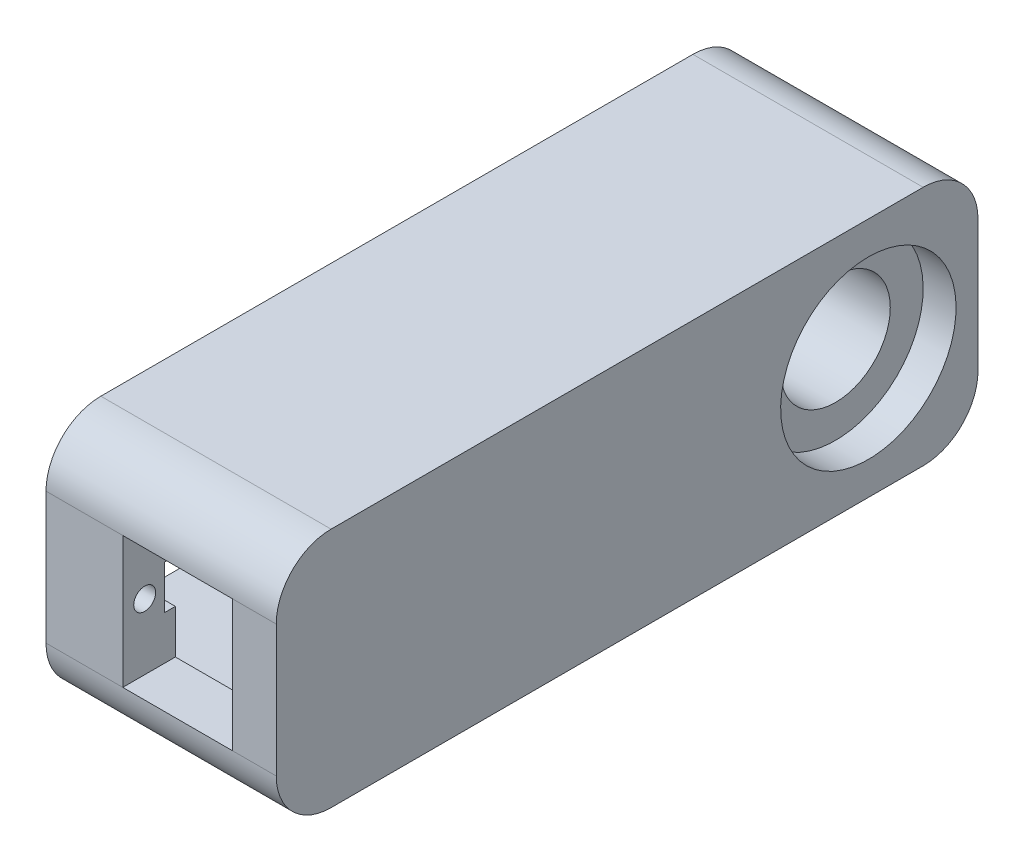
ISO-10303-21;
HEADER;
FILE_DESCRIPTION(('STEP AP214'),'2;1');
FILE_NAME('part.step','',(''),(''),'','','');
FILE_SCHEMA(('AUTOMOTIVE_DESIGN { 1 0 10303 214 1 1 1 1 }'));
ENDSEC;
DATA;
#1=APPLICATION_CONTEXT('core data for automotive mechanical design processes');
#2=APPLICATION_PROTOCOL_DEFINITION('international standard','automotive_design',2000,#1);
#3=PRODUCT_CONTEXT('',#1,'mechanical');
#4=PRODUCT('Part','Part','',(#3));
#5=PRODUCT_RELATED_PRODUCT_CATEGORY('part','',(#4));
#6=PRODUCT_DEFINITION_FORMATION('','',#4);
#7=PRODUCT_DEFINITION_CONTEXT('part definition',#1,'design');
#8=PRODUCT_DEFINITION('design','',#6,#7);
#9=PRODUCT_DEFINITION_SHAPE('','',#8);
#10=(LENGTH_UNIT() NAMED_UNIT(*) SI_UNIT(.MILLI.,.METRE.));
#11=(NAMED_UNIT(*) PLANE_ANGLE_UNIT() SI_UNIT($,.RADIAN.));
#12=(NAMED_UNIT(*) SI_UNIT($,.STERADIAN.) SOLID_ANGLE_UNIT());
#13=UNCERTAINTY_MEASURE_WITH_UNIT(LENGTH_MEASURE(1.E-05),#10,'distance_accuracy_value','');
#14=(GEOMETRIC_REPRESENTATION_CONTEXT(3) GLOBAL_UNCERTAINTY_ASSIGNED_CONTEXT((#13)) GLOBAL_UNIT_ASSIGNED_CONTEXT((#10,
#11,#12)) REPRESENTATION_CONTEXT('',''));
#15=CARTESIAN_POINT('',(0.,0.,0.));
#16=DIRECTION('',(0.,0.,1.));
#17=DIRECTION('',(1.,0.,0.));
#18=AXIS2_PLACEMENT_3D('',#15,#16,#17);
#19=CARTESIAN_POINT('',(72.2543738784994,65.0424365132959,-66.5000000745058));
#20=DIRECTION('',(-1.,0.,0.));
#21=DIRECTION('',(0.,-1.,0.));
#22=AXIS2_PLACEMENT_3D('',#19,#20,#21);
#23=CYLINDRICAL_SURFACE('',#22,5.);
#24=CARTESIAN_POINT('',(37.1122382547684,65.0424365132959,-66.5000000745058));
#25=DIRECTION('',(-1.,0.,0.));
#26=DIRECTION('',(0.,-1.,0.));
#27=AXIS2_PLACEMENT_3D('',#24,#25,#26);
#28=CIRCLE('',#27,5.);
#29=CARTESIAN_POINT('',(37.1122382547684,60.0424365132959,-66.5000000745058));
#30=VERTEX_POINT('',#29);
#31=EDGE_CURVE('E244',#30,#30,#28,.T.);
#32=ORIENTED_EDGE('',*,*,#31,.T.);
#33=EDGE_LOOP('',(#32));
#34=FACE_BOUND('',#33,.T.);
#35=CARTESIAN_POINT('',(55.1122382547684,65.0424365132959,-66.5000000745058));
#36=DIRECTION('',(1.,0.,0.));
#37=DIRECTION('',(0.,1.,0.));
#38=AXIS2_PLACEMENT_3D('',#35,#36,#37);
#39=CIRCLE('',#38,5.);
#40=CARTESIAN_POINT('',(55.1122382547684,70.0424365132959,-66.5000000745058));
#41=VERTEX_POINT('',#40);
#42=EDGE_CURVE('E40',#41,#41,#39,.F.);
#43=ORIENTED_EDGE('',*,*,#42,.F.);
#44=EDGE_LOOP('',(#43));
#45=FACE_BOUND('',#44,.T.);
#46=ADVANCED_FACE('F36',(#34,#45),#23,.F.);
#47=CARTESIAN_POINT('',(37.1122382547684,65.0424365132959,-14.9999998733401));
#48=DIRECTION('',(-1.,0.,0.));
#49=DIRECTION('',(0.,0.,1.));
#50=AXIS2_PLACEMENT_3D('',#47,#48,#49);
#51=PLANE('',#50);
#52=DIRECTION('',(0.,0.,1.));
#53=VECTOR('',#52,1.);
#54=CARTESIAN_POINT('',(37.1122382547684,67.0424365132959,-17.299999910593));
#55=LINE('',#54,#53);
#56=CARTESIAN_POINT('',(37.1122382547684,67.0424365132959,-17.299999910593));
#57=VERTEX_POINT('',#56);
#58=CARTESIAN_POINT('',(37.1122382547684,67.0424365132959,-16.299999910593));
#59=VERTEX_POINT('',#58);
#60=EDGE_CURVE('E313',#57,#59,#55,.T.);
#61=ORIENTED_EDGE('',*,*,#60,.T.);
#62=DIRECTION('',(0.,-1.,0.));
#63=VECTOR('',#62,1.);
#64=CARTESIAN_POINT('',(37.1122382547684,63.0424365132959,-16.299999910593));
#65=LINE('',#64,#63);
#66=CARTESIAN_POINT('',(37.1122382547684,63.0424365132959,-16.299999910593));
#67=VERTEX_POINT('',#66);
#68=EDGE_CURVE('E282',#59,#67,#65,.T.);
#69=ORIENTED_EDGE('',*,*,#68,.T.);
#70=DIRECTION('',(0.,0.,-1.));
#71=VECTOR('',#70,1.);
#72=CARTESIAN_POINT('',(37.1122382547684,63.0424365132959,-17.299999910593));
#73=LINE('',#72,#71);
#74=CARTESIAN_POINT('',(37.1122382547684,63.0424365132959,-17.299999910593));
#75=VERTEX_POINT('',#74);
#76=EDGE_CURVE('E316',#67,#75,#73,.T.);
#77=ORIENTED_EDGE('',*,*,#76,.T.);
#78=DIRECTION('',(0.,1.,0.));
#79=VECTOR('',#78,1.);
#80=CARTESIAN_POINT('',(37.1122382547684,71.2424366027028,-17.299999910593));
#81=LINE('',#80,#79);
#82=CARTESIAN_POINT('',(37.1122382547684,58.8424364238889,-17.299999910593));
#83=VERTEX_POINT('',#82);
#84=EDGE_CURVE('E273',#83,#75,#81,.T.);
#85=ORIENTED_EDGE('',*,*,#84,.F.);
#86=DIRECTION('',(0.,0.,1.));
#87=VECTOR('',#86,1.);
#88=CARTESIAN_POINT('',(37.1122382547684,58.8424364238889,-39.7000002384186));
#89=LINE('',#88,#87);
#90=CARTESIAN_POINT('',(37.1122382547684,58.8424364238889,-39.7000002384186));
#91=VERTEX_POINT('',#90);
#92=EDGE_CURVE('E277',#91,#83,#89,.T.);
#93=ORIENTED_EDGE('',*,*,#92,.F.);
#94=DIRECTION('',(0.,-1.,0.));
#95=VECTOR('',#94,1.);
#96=CARTESIAN_POINT('',(37.1122382547684,71.2424366027028,-39.7000002384186));
#97=LINE('',#96,#95);
#98=CARTESIAN_POINT('',(37.1122382547684,71.2424366027028,-39.7000002384186));
#99=VERTEX_POINT('',#98);
#100=EDGE_CURVE('E280',#99,#91,#97,.T.);
#101=ORIENTED_EDGE('',*,*,#100,.F.);
#102=DIRECTION('',(0.,0.,-1.));
#103=VECTOR('',#102,1.);
#104=CARTESIAN_POINT('',(37.1122382547684,71.2424366027028,-39.7000002384186));
#105=LINE('',#104,#103);
#106=CARTESIAN_POINT('',(37.1122382547684,71.2424366027028,-17.299999910593));
#107=VERTEX_POINT('',#106);
#108=EDGE_CURVE('E269',#107,#99,#105,.T.);
#109=ORIENTED_EDGE('',*,*,#108,.F.);
#110=EDGE_CURVE('E276',#57,#107,#81,.T.);
#111=ORIENTED_EDGE('',*,*,#110,.F.);
#112=EDGE_LOOP('',(#61,#69,#77,#85,#93,#101,#109,#111));
#113=FACE_BOUND('',#112,.T.);
#114=ORIENTED_EDGE('',*,*,#31,.F.);
#115=EDGE_LOOP('',(#114));
#116=FACE_BOUND('',#115,.T.);
#117=CARTESIAN_POINT('',(37.1122382547684,65.0424365132959,-14.4999998360872));
#118=DIRECTION('',(-1.,0.,0.));
#119=DIRECTION('',(0.,-1.,0.));
#120=AXIS2_PLACEMENT_3D('',#117,#118,#119);
#121=CIRCLE('',#120,0.999999999999964);
#122=CARTESIAN_POINT('',(37.1122382547684,64.0424365132959,-14.4999998360872));
#123=VERTEX_POINT('',#122);
#124=EDGE_CURVE('E240',#123,#123,#121,.T.);
#125=ORIENTED_EDGE('',*,*,#124,.F.);
#126=EDGE_LOOP('',(#125));
#127=FACE_BOUND('',#126,.T.);
#128=CARTESIAN_POINT('',(37.1122382547684,65.0424365132959,-42.5000003129244));
#129=DIRECTION('',(-1.,0.,0.));
#130=DIRECTION('',(0.,-1.,0.));
#131=AXIS2_PLACEMENT_3D('',#128,#129,#130);
#132=CIRCLE('',#131,0.999999999999968);
#133=CARTESIAN_POINT('',(37.1122382547684,64.0424365132959,-42.5000003129244));
#134=VERTEX_POINT('',#133);
#135=EDGE_CURVE('E241',#134,#134,#132,.T.);
#136=ORIENTED_EDGE('',*,*,#135,.F.);
#137=EDGE_LOOP('',(#136));
#138=FACE_BOUND('',#137,.T.);
#139=DIRECTION('',(0.,0.,-1.));
#140=VECTOR('',#139,1.);
#141=CARTESIAN_POINT('',(37.1122382547684,54.0424365132959,-12.5000000745058));
#142=LINE('',#141,#140);
#143=CARTESIAN_POINT('',(37.1122382547684,54.0424365132959,-17.5000000745058));
#144=VERTEX_POINT('',#143);
#145=CARTESIAN_POINT('',(37.1122382547684,54.0424365132959,-71.5000000745058));
#146=VERTEX_POINT('',#145);
#147=EDGE_CURVE('E192',#144,#146,#142,.T.);
#148=ORIENTED_EDGE('',*,*,#147,.F.);
#149=CARTESIAN_POINT('',(37.1122382547684,59.0424365132959,-17.5000000745058));
#150=DIRECTION('',(1.,0.,0.));
#151=DIRECTION('',(0.,1.,0.));
#152=AXIS2_PLACEMENT_3D('',#149,#150,#151);
#153=CIRCLE('',#152,5.);
#154=CARTESIAN_POINT('',(37.1122382547684,59.0424365132959,-12.5000000745058));
#155=VERTEX_POINT('',#154);
#156=EDGE_CURVE('E340',#155,#144,#153,.T.);
#157=ORIENTED_EDGE('',*,*,#156,.F.);
#158=DIRECTION('',(0.,-1.,0.));
#159=VECTOR('',#158,1.);
#160=CARTESIAN_POINT('',(37.1122382547684,76.0424365132959,-12.5000000745058));
#161=LINE('',#160,#159);
#162=CARTESIAN_POINT('',(37.1122382547684,71.0424365132959,-12.5000000745058));
#163=VERTEX_POINT('',#162);
#164=EDGE_CURVE('E196',#163,#155,#161,.T.);
#165=ORIENTED_EDGE('',*,*,#164,.F.);
#166=CARTESIAN_POINT('',(37.1122382547684,71.0424365132959,-17.5000000745058));
#167=DIRECTION('',(1.,0.,0.));
#168=DIRECTION('',(0.,1.,0.));
#169=AXIS2_PLACEMENT_3D('',#166,#167,#168);
#170=CIRCLE('',#169,5.);
#171=CARTESIAN_POINT('',(37.1122382547684,76.0424365132959,-17.5000000745058));
#172=VERTEX_POINT('',#171);
#173=EDGE_CURVE('E324',#172,#163,#170,.T.);
#174=ORIENTED_EDGE('',*,*,#173,.F.);
#175=DIRECTION('',(0.,0.,1.));
#176=VECTOR('',#175,1.);
#177=CARTESIAN_POINT('',(37.1122382547684,76.0424365132959,-76.5000000745058));
#178=LINE('',#177,#176);
#179=CARTESIAN_POINT('',(37.1122382547684,76.0424365132959,-71.5000000745058));
#180=VERTEX_POINT('',#179);
#181=EDGE_CURVE('E45',#180,#172,#178,.T.);
#182=ORIENTED_EDGE('',*,*,#181,.F.);
#183=CARTESIAN_POINT('',(37.1122382547684,71.0424365132959,-71.5000000745058));
#184=DIRECTION('',(1.,0.,0.));
#185=DIRECTION('',(0.,1.,0.));
#186=AXIS2_PLACEMENT_3D('',#183,#184,#185);
#187=CIRCLE('',#186,5.);
#188=CARTESIAN_POINT('',(37.1122382547684,71.0424365132959,-76.5000000745058));
#189=VERTEX_POINT('',#188);
#190=EDGE_CURVE('E175',#189,#180,#187,.T.);
#191=ORIENTED_EDGE('',*,*,#190,.F.);
#192=DIRECTION('',(0.,1.,0.));
#193=VECTOR('',#192,1.);
#194=CARTESIAN_POINT('',(37.1122382547684,54.0424365132959,-76.5000000745058));
#195=LINE('',#194,#193);
#196=CARTESIAN_POINT('',(37.1122382547684,59.0424365132959,-76.5000000745058));
#197=VERTEX_POINT('',#196);
#198=EDGE_CURVE('E187',#197,#189,#195,.T.);
#199=ORIENTED_EDGE('',*,*,#198,.F.);
#200=CARTESIAN_POINT('',(37.1122382547684,59.0424365132959,-71.5000000745058));
#201=DIRECTION('',(1.,0.,0.));
#202=DIRECTION('',(0.,1.,0.));
#203=AXIS2_PLACEMENT_3D('',#200,#201,#202);
#204=CIRCLE('',#203,5.);
#205=EDGE_CURVE('E344',#197,#146,#204,.F.);
#206=ORIENTED_EDGE('',*,*,#205,.T.);
#207=EDGE_LOOP('',(#148,#157,#165,#174,#182,#191,#199,#206));
#208=FACE_BOUND('',#207,.T.);
#209=ADVANCED_FACE('F38',(#113,#116,#127,#138,#208),#51,.T.);
#210=CARTESIAN_POINT('',(-30.5634590079861,76.0424365132959,-12.5000000745058));
#211=DIRECTION('',(0.,0.,1.));
#212=DIRECTION('',(1.,0.,0.));
#213=AXIS2_PLACEMENT_3D('',#210,#211,#212);
#214=PLANE('',#213);
#215=ORIENTED_EDGE('',*,*,#164,.T.);
#216=DIRECTION('',(1.,0.,0.));
#217=VECTOR('',#216,1.);
#218=CARTESIAN_POINT('',(37.1122382547684,59.0424365132959,-12.5000000745058));
#219=LINE('',#218,#217);
#220=CARTESIAN_POINT('',(44.1122382547684,59.0424365132959,-12.5000000745058));
#221=VERTEX_POINT('',#220);
#222=EDGE_CURVE('E330',#155,#221,#219,.T.);
#223=ORIENTED_EDGE('',*,*,#222,.T.);
#224=DIRECTION('',(0.,-1.,0.));
#225=VECTOR('',#224,1.);
#226=CARTESIAN_POINT('',(44.1122382547684,71.0424365132959,-12.5000000745058));
#227=LINE('',#226,#225);
#228=CARTESIAN_POINT('',(44.1122382547684,71.0424365132959,-12.5000000745058));
#229=VERTEX_POINT('',#228);
#230=EDGE_CURVE('E227',#229,#221,#227,.T.);
#231=ORIENTED_EDGE('',*,*,#230,.F.);
#232=DIRECTION('',(1.,0.,0.));
#233=VECTOR('',#232,1.);
#234=CARTESIAN_POINT('',(37.1122382547684,71.0424365132959,-12.5000000745058));
#235=LINE('',#234,#233);
#236=EDGE_CURVE('E319',#163,#229,#235,.T.);
#237=ORIENTED_EDGE('',*,*,#236,.F.);
#238=EDGE_LOOP('',(#215,#223,#231,#237));
#239=FACE_BOUND('',#238,.T.);
#240=ADVANCED_FACE('F369',(#239),#214,.T.);
#241=DIRECTION('',(0.,1.,0.));
#242=VECTOR('',#241,1.);
#243=CARTESIAN_POINT('',(54.1122382547684,71.0424365132959,-12.5000000745058));
#244=LINE('',#243,#242);
#245=CARTESIAN_POINT('',(54.1122382547684,59.0424365132959,-12.5000000745058));
#246=VERTEX_POINT('',#245);
#247=CARTESIAN_POINT('',(54.1122382547684,71.0424365132959,-12.5000000745058));
#248=VERTEX_POINT('',#247);
#249=EDGE_CURVE('E233',#246,#248,#244,.T.);
#250=ORIENTED_EDGE('',*,*,#249,.F.);
#251=CARTESIAN_POINT('',(58.1122382547684,59.0424365132959,-12.5000000745058));
#252=VERTEX_POINT('',#251);
#253=EDGE_CURVE('E334',#246,#252,#219,.T.);
#254=ORIENTED_EDGE('',*,*,#253,.T.);
#255=DIRECTION('',(0.,-1.,0.));
#256=VECTOR('',#255,1.);
#257=CARTESIAN_POINT('',(58.1122382547684,76.0424365132959,-12.5000000745058));
#258=LINE('',#257,#256);
#259=CARTESIAN_POINT('',(58.1122382547684,71.0424365132959,-12.5000000745058));
#260=VERTEX_POINT('',#259);
#261=EDGE_CURVE('E206',#260,#252,#258,.T.);
#262=ORIENTED_EDGE('',*,*,#261,.F.);
#263=EDGE_CURVE('E323',#248,#260,#235,.T.);
#264=ORIENTED_EDGE('',*,*,#263,.F.);
#265=EDGE_LOOP('',(#250,#254,#262,#264));
#266=FACE_BOUND('',#265,.T.);
#267=ADVANCED_FACE('F416',(#266),#214,.T.);
#268=CARTESIAN_POINT('',(-30.5634590079861,54.0424365132958,-76.5000000745058));
#269=DIRECTION('',(0.,0.,-1.));
#270=DIRECTION('',(-1.,0.,0.));
#271=AXIS2_PLACEMENT_3D('',#268,#269,#270);
#272=PLANE('',#271);
#273=DIRECTION('',(0.,1.,0.));
#274=VECTOR('',#273,1.);
#275=CARTESIAN_POINT('',(58.1122382547684,54.0424365132959,-76.5000000745058));
#276=LINE('',#275,#274);
#277=CARTESIAN_POINT('',(58.1122382547684,59.0424365132959,-76.5000000745058));
#278=VERTEX_POINT('',#277);
#279=CARTESIAN_POINT('',(58.1122382547684,71.0424365132959,-76.5000000745058));
#280=VERTEX_POINT('',#279);
#281=EDGE_CURVE('E201',#278,#280,#276,.T.);
#282=ORIENTED_EDGE('',*,*,#281,.F.);
#283=DIRECTION('',(1.,0.,0.));
#284=VECTOR('',#283,1.);
#285=CARTESIAN_POINT('',(37.1122382547684,59.0424365132959,-76.5000000745058));
#286=LINE('',#285,#284);
#287=EDGE_CURVE('E52',#197,#278,#286,.T.);
#288=ORIENTED_EDGE('',*,*,#287,.F.);
#289=ORIENTED_EDGE('',*,*,#198,.T.);
#290=DIRECTION('',(1.,0.,0.));
#291=VECTOR('',#290,1.);
#292=CARTESIAN_POINT('',(37.1122382547684,71.0424365132959,-76.5000000745058));
#293=LINE('',#292,#291);
#294=EDGE_CURVE('E172',#189,#280,#293,.T.);
#295=ORIENTED_EDGE('',*,*,#294,.T.);
#296=EDGE_LOOP('',(#282,#288,#289,#295));
#297=FACE_BOUND('',#296,.T.);
#298=ADVANCED_FACE('F191',(#297),#272,.T.);
#299=CARTESIAN_POINT('',(-30.5634590079861,76.0424365132959,-76.5000000745058));
#300=DIRECTION('',(0.,1.,0.));
#301=DIRECTION('',(-1.,0.,0.));
#302=AXIS2_PLACEMENT_3D('',#299,#300,#301);
#303=PLANE('',#302);
#304=DIRECTION('',(1.,0.,0.));
#305=VECTOR('',#304,1.);
#306=CARTESIAN_POINT('',(37.1122382547684,76.0424365132959,-71.5000000745058));
#307=LINE('',#306,#305);
#308=CARTESIAN_POINT('',(58.1122382547684,76.0424365132959,-71.5000000745058));
#309=VERTEX_POINT('',#308);
#310=EDGE_CURVE('E60',#180,#309,#307,.T.);
#311=ORIENTED_EDGE('',*,*,#310,.F.);
#312=ORIENTED_EDGE('',*,*,#181,.T.);
#313=DIRECTION('',(1.,0.,0.));
#314=VECTOR('',#313,1.);
#315=CARTESIAN_POINT('',(37.1122382547684,76.0424365132959,-17.5000000745058));
#316=LINE('',#315,#314);
#317=CARTESIAN_POINT('',(58.1122382547684,76.0424365132959,-17.5000000745058));
#318=VERTEX_POINT('',#317);
#319=EDGE_CURVE('E320',#172,#318,#316,.T.);
#320=ORIENTED_EDGE('',*,*,#319,.T.);
#321=DIRECTION('',(0.,0.,1.));
#322=VECTOR('',#321,1.);
#323=CARTESIAN_POINT('',(58.1122382547684,76.0424365132959,-76.5000000745058));
#324=LINE('',#323,#322);
#325=EDGE_CURVE('E209',#309,#318,#324,.T.);
#326=ORIENTED_EDGE('',*,*,#325,.F.);
#327=EDGE_LOOP('',(#311,#312,#320,#326));
#328=FACE_BOUND('',#327,.T.);
#329=ADVANCED_FACE('F409',(#328),#303,.T.);
#330=CARTESIAN_POINT('',(58.1122382547684,0.,0.));
#331=DIRECTION('',(1.,0.,0.));
#332=DIRECTION('',(0.,1.,0.));
#333=AXIS2_PLACEMENT_3D('',#330,#331,#332);
#334=PLANE('',#333);
#335=CARTESIAN_POINT('',(58.1122382547684,65.0424365132959,-66.5000000745058));
#336=DIRECTION('',(1.,0.,0.));
#337=DIRECTION('',(0.,1.,0.));
#338=AXIS2_PLACEMENT_3D('',#335,#336,#337);
#339=CIRCLE('',#338,7.99999999999999);
#340=CARTESIAN_POINT('',(58.1122382547684,73.0424365132959,-66.5000000745058));
#341=VERTEX_POINT('',#340);
#342=EDGE_CURVE('E351',#341,#341,#339,.T.);
#343=ORIENTED_EDGE('',*,*,#342,.F.);
#344=EDGE_LOOP('',(#343));
#345=FACE_BOUND('',#344,.T.);
#346=ORIENTED_EDGE('',*,*,#261,.T.);
#347=CARTESIAN_POINT('',(58.1122382547684,59.0424365132959,-17.5000000745058));
#348=DIRECTION('',(1.,0.,0.));
#349=DIRECTION('',(0.,1.,0.));
#350=AXIS2_PLACEMENT_3D('',#347,#348,#349);
#351=CIRCLE('',#350,5.);
#352=CARTESIAN_POINT('',(58.1122382547684,54.0424365132959,-17.5000000745058));
#353=VERTEX_POINT('',#352);
#354=EDGE_CURVE('E337',#252,#353,#351,.T.);
#355=ORIENTED_EDGE('',*,*,#354,.T.);
#356=DIRECTION('',(0.,0.,-1.));
#357=VECTOR('',#356,1.);
#358=CARTESIAN_POINT('',(58.1122382547684,54.0424365132959,-12.5000000745058));
#359=LINE('',#358,#357);
#360=CARTESIAN_POINT('',(58.1122382547684,54.0424365132959,-71.5000000745058));
#361=VERTEX_POINT('',#360);
#362=EDGE_CURVE('E203',#353,#361,#359,.T.);
#363=ORIENTED_EDGE('',*,*,#362,.T.);
#364=CARTESIAN_POINT('',(58.1122382547684,59.0424365132959,-71.5000000745058));
#365=DIRECTION('',(1.,0.,0.));
#366=DIRECTION('',(0.,1.,0.));
#367=AXIS2_PLACEMENT_3D('',#364,#365,#366);
#368=CIRCLE('',#367,5.);
#369=EDGE_CURVE('E336',#278,#361,#368,.F.);
#370=ORIENTED_EDGE('',*,*,#369,.F.);
#371=ORIENTED_EDGE('',*,*,#281,.T.);
#372=CARTESIAN_POINT('',(58.1122382547684,71.0424365132959,-71.5000000745058));
#373=DIRECTION('',(1.,0.,0.));
#374=DIRECTION('',(0.,1.,0.));
#375=AXIS2_PLACEMENT_3D('',#372,#373,#374);
#376=CIRCLE('',#375,5.);
#377=EDGE_CURVE('E176',#280,#309,#376,.T.);
#378=ORIENTED_EDGE('',*,*,#377,.T.);
#379=ORIENTED_EDGE('',*,*,#325,.T.);
#380=CARTESIAN_POINT('',(58.1122382547684,71.0424365132959,-17.5000000745058));
#381=DIRECTION('',(1.,0.,0.));
#382=DIRECTION('',(0.,1.,0.));
#383=AXIS2_PLACEMENT_3D('',#380,#381,#382);
#384=CIRCLE('',#383,5.);
#385=EDGE_CURVE('E326',#318,#260,#384,.T.);
#386=ORIENTED_EDGE('',*,*,#385,.T.);
#387=EDGE_LOOP('',(#346,#355,#363,#370,#371,#378,#379,#386));
#388=FACE_BOUND('',#387,.T.);
#389=ADVANCED_FACE('F405',(#345,#388),#334,.T.);
#390=CARTESIAN_POINT('',(54.1122382547684,71.2424366027028,-17.299999910593));
#391=DIRECTION('',(0.,0.,1.));
#392=DIRECTION('',(1.,0.,0.));
#393=AXIS2_PLACEMENT_3D('',#390,#391,#392);
#394=PLANE('',#393);
#395=DIRECTION('',(0.,1.,0.));
#396=VECTOR('',#395,1.);
#397=CARTESIAN_POINT('',(44.1122382547684,71.0424365132959,-17.299999910593));
#398=LINE('',#397,#396);
#399=CARTESIAN_POINT('',(44.1122382547684,67.0424365132959,-17.299999910593));
#400=VERTEX_POINT('',#399);
#401=CARTESIAN_POINT('',(44.1122382547684,71.0424365132959,-17.299999910593));
#402=VERTEX_POINT('',#401);
#403=EDGE_CURVE('E257',#400,#402,#398,.T.);
#404=ORIENTED_EDGE('',*,*,#403,.F.);
#405=DIRECTION('',(1.,0.,0.));
#406=VECTOR('',#405,1.);
#407=CARTESIAN_POINT('',(37.1112382547684,67.0424365132959,-17.299999910593));
#408=LINE('',#407,#406);
#409=EDGE_CURVE('E296',#57,#400,#408,.T.);
#410=ORIENTED_EDGE('',*,*,#409,.F.);
#411=ORIENTED_EDGE('',*,*,#110,.T.);
#412=DIRECTION('',(-1.,0.,0.));
#413=VECTOR('',#412,1.);
#414=CARTESIAN_POINT('',(54.1122382547684,71.2424366027028,-17.299999910593));
#415=LINE('',#414,#413);
#416=CARTESIAN_POINT('',(54.1122382547684,71.2424366027028,-17.299999910593));
#417=VERTEX_POINT('',#416);
#418=EDGE_CURVE('E264',#417,#107,#415,.T.);
#419=ORIENTED_EDGE('',*,*,#418,.F.);
#420=DIRECTION('',(0.,1.,0.));
#421=VECTOR('',#420,1.);
#422=CARTESIAN_POINT('',(54.1122382547684,71.2424366027028,-17.299999910593));
#423=LINE('',#422,#421);
#424=CARTESIAN_POINT('',(54.1122382547684,71.0424365132959,-17.299999910593));
#425=VERTEX_POINT('',#424);
#426=EDGE_CURVE('E288',#425,#417,#423,.T.);
#427=ORIENTED_EDGE('',*,*,#426,.F.);
#428=DIRECTION('',(1.,0.,0.));
#429=VECTOR('',#428,1.);
#430=CARTESIAN_POINT('',(54.1122382547684,71.0424365132959,-17.299999910593));
#431=LINE('',#430,#429);
#432=EDGE_CURVE('E11',#402,#425,#431,.T.);
#433=ORIENTED_EDGE('',*,*,#432,.F.);
#434=EDGE_LOOP('',(#404,#410,#411,#419,#427,#433));
#435=FACE_BOUND('',#434,.T.);
#436=ADVANCED_FACE('F408',(#435),#394,.F.);
#437=CARTESIAN_POINT('',(-30.5634590079861,54.0424365132958,-12.5000000745058));
#438=DIRECTION('',(0.,-1.,0.));
#439=DIRECTION('',(1.,0.,0.));
#440=AXIS2_PLACEMENT_3D('',#437,#438,#439);
#441=PLANE('',#440);
#442=DIRECTION('',(1.,0.,0.));
#443=VECTOR('',#442,1.);
#444=CARTESIAN_POINT('',(37.1122382547684,54.0424365132959,-17.5000000745058));
#445=LINE('',#444,#443);
#446=EDGE_CURVE('E333',#144,#353,#445,.T.);
#447=ORIENTED_EDGE('',*,*,#446,.F.);
#448=ORIENTED_EDGE('',*,*,#147,.T.);
#449=DIRECTION('',(1.,0.,0.));
#450=VECTOR('',#449,1.);
#451=CARTESIAN_POINT('',(37.1122382547684,54.0424365132959,-71.5000000745058));
#452=LINE('',#451,#450);
#453=EDGE_CURVE('E343',#146,#361,#452,.T.);
#454=ORIENTED_EDGE('',*,*,#453,.T.);
#455=ORIENTED_EDGE('',*,*,#362,.F.);
#456=EDGE_LOOP('',(#447,#448,#454,#455));
#457=FACE_BOUND('',#456,.T.);
#458=ADVANCED_FACE('F403',(#457),#441,.T.);
#459=CARTESIAN_POINT('',(54.1122382547684,71.0424365132959,-17.5000000745058));
#460=DIRECTION('',(1.,0.,0.));
#461=DIRECTION('',(0.,0.,-1.));
#462=AXIS2_PLACEMENT_3D('',#459,#460,#461);
#463=PLANE('',#462);
#464=DIRECTION('',(0.,0.,1.));
#465=VECTOR('',#464,1.);
#466=CARTESIAN_POINT('',(54.1122382547684,71.0424365132959,-17.5000000745058));
#467=LINE('',#466,#465);
#468=EDGE_CURVE('E213',#425,#248,#467,.T.);
#469=ORIENTED_EDGE('',*,*,#468,.F.);
#470=ORIENTED_EDGE('',*,*,#426,.T.);
#471=DIRECTION('',(0.,0.,-1.));
#472=VECTOR('',#471,1.);
#473=CARTESIAN_POINT('',(54.1122382547684,71.2424366027028,-39.7000002384186));
#474=LINE('',#473,#472);
#475=CARTESIAN_POINT('',(54.1122382547684,71.2424366027028,-39.7000002384186));
#476=VERTEX_POINT('',#475);
#477=EDGE_CURVE('E262',#417,#476,#474,.T.);
#478=ORIENTED_EDGE('',*,*,#477,.T.);
#479=DIRECTION('',(0.,-1.,0.));
#480=VECTOR('',#479,1.);
#481=CARTESIAN_POINT('',(54.1122382547684,71.2424366027028,-39.7000002384186));
#482=LINE('',#481,#480);
#483=CARTESIAN_POINT('',(54.1122382547684,58.8424364238889,-39.7000002384186));
#484=VERTEX_POINT('',#483);
#485=EDGE_CURVE('E272',#476,#484,#482,.T.);
#486=ORIENTED_EDGE('',*,*,#485,.T.);
#487=DIRECTION('',(0.,0.,1.));
#488=VECTOR('',#487,1.);
#489=CARTESIAN_POINT('',(54.1122382547684,58.8424364238889,-39.7000002384186));
#490=LINE('',#489,#488);
#491=CARTESIAN_POINT('',(54.1122382547684,58.8424364238889,-17.299999910593));
#492=VERTEX_POINT('',#491);
#493=EDGE_CURVE('E289',#484,#492,#490,.T.);
#494=ORIENTED_EDGE('',*,*,#493,.T.);
#495=CARTESIAN_POINT('',(54.1122382547684,59.0424365132959,-17.299999910593));
#496=VERTEX_POINT('',#495);
#497=EDGE_CURVE('E285',#492,#496,#423,.T.);
#498=ORIENTED_EDGE('',*,*,#497,.T.);
#499=DIRECTION('',(0.,0.,1.));
#500=VECTOR('',#499,1.);
#501=CARTESIAN_POINT('',(54.1122382547684,59.0424365132959,-17.5000000745058));
#502=LINE('',#501,#500);
#503=EDGE_CURVE('E212',#496,#246,#502,.T.);
#504=ORIENTED_EDGE('',*,*,#503,.T.);
#505=ORIENTED_EDGE('',*,*,#249,.T.);
#506=EDGE_LOOP('',(#469,#470,#478,#486,#494,#498,#504,#505));
#507=FACE_BOUND('',#506,.T.);
#508=ADVANCED_FACE('F393',(#507),#463,.F.);
#509=CARTESIAN_POINT('',(54.1122382547684,59.0424365132959,-17.5000000745058));
#510=DIRECTION('',(0.,-1.,0.));
#511=DIRECTION('',(0.,0.,-1.));
#512=AXIS2_PLACEMENT_3D('',#509,#510,#511);
#513=PLANE('',#512);
#514=ORIENTED_EDGE('',*,*,#503,.F.);
#515=DIRECTION('',(-1.,0.,0.));
#516=VECTOR('',#515,1.);
#517=CARTESIAN_POINT('',(54.1122382547684,59.0424365132959,-17.299999910593));
#518=LINE('',#517,#516);
#519=CARTESIAN_POINT('',(44.1122382547684,59.0424365132959,-17.299999910593));
#520=VERTEX_POINT('',#519);
#521=EDGE_CURVE('E251',#496,#520,#518,.T.);
#522=ORIENTED_EDGE('',*,*,#521,.T.);
#523=DIRECTION('',(0.,0.,1.));
#524=VECTOR('',#523,1.);
#525=CARTESIAN_POINT('',(44.1122382547684,59.0424365132959,-17.5000000745058));
#526=LINE('',#525,#524);
#527=EDGE_CURVE('E220',#520,#221,#526,.T.);
#528=ORIENTED_EDGE('',*,*,#527,.T.);
#529=DIRECTION('',(1.,0.,0.));
#530=VECTOR('',#529,1.);
#531=CARTESIAN_POINT('',(54.1122382547684,59.0424365132959,-12.5000000745058));
#532=LINE('',#531,#530);
#533=EDGE_CURVE('E217',#221,#246,#532,.T.);
#534=ORIENTED_EDGE('',*,*,#533,.T.);
#535=EDGE_LOOP('',(#514,#522,#528,#534));
#536=FACE_BOUND('',#535,.T.);
#537=ADVANCED_FACE('F389',(#536),#513,.F.);
#538=CARTESIAN_POINT('',(44.1122382547684,71.0424365132959,-17.5000000745058));
#539=DIRECTION('',(-1.,0.,0.));
#540=DIRECTION('',(0.,0.,1.));
#541=AXIS2_PLACEMENT_3D('',#538,#539,#540);
#542=PLANE('',#541);
#543=CARTESIAN_POINT('',(44.1122382547684,65.0424365132959,-14.4999998360872));
#544=DIRECTION('',(-1.,0.,0.));
#545=DIRECTION('',(0.,0.,1.));
#546=AXIS2_PLACEMENT_3D('',#543,#544,#545);
#547=CIRCLE('',#546,0.999999999999964);
#548=CARTESIAN_POINT('',(44.1122382547684,65.0424365132959,-13.4999998360872));
#549=VERTEX_POINT('',#548);
#550=EDGE_CURVE('E236',#549,#549,#547,.F.);
#551=ORIENTED_EDGE('',*,*,#550,.F.);
#552=EDGE_LOOP('',(#551));
#553=FACE_BOUND('',#552,.T.);
#554=DIRECTION('',(0.,-1.,0.));
#555=VECTOR('',#554,1.);
#556=CARTESIAN_POINT('',(44.1122382547684,63.0424365132959,-16.299999910593));
#557=LINE('',#556,#555);
#558=CARTESIAN_POINT('',(44.1122382547684,67.0424365132959,-16.299999910593));
#559=VERTEX_POINT('',#558);
#560=CARTESIAN_POINT('',(44.1122382547684,63.0424365132959,-16.299999910593));
#561=VERTEX_POINT('',#560);
#562=EDGE_CURVE('E307',#559,#561,#557,.T.);
#563=ORIENTED_EDGE('',*,*,#562,.F.);
#564=DIRECTION('',(0.,0.,1.));
#565=VECTOR('',#564,1.);
#566=CARTESIAN_POINT('',(44.1122382547684,67.0424365132959,-17.299999910593));
#567=LINE('',#566,#565);
#568=EDGE_CURVE('E310',#400,#559,#567,.T.);
#569=ORIENTED_EDGE('',*,*,#568,.F.);
#570=ORIENTED_EDGE('',*,*,#403,.T.);
#571=DIRECTION('',(0.,0.,1.));
#572=VECTOR('',#571,1.);
#573=CARTESIAN_POINT('',(44.1122382547684,71.0424365132959,-17.5000000745058));
#574=LINE('',#573,#572);
#575=EDGE_CURVE('E216',#402,#229,#574,.T.);
#576=ORIENTED_EDGE('',*,*,#575,.T.);
#577=ORIENTED_EDGE('',*,*,#230,.T.);
#578=ORIENTED_EDGE('',*,*,#527,.F.);
#579=CARTESIAN_POINT('',(44.1122382547684,63.0424365132959,-17.299999910593));
#580=VERTEX_POINT('',#579);
#581=EDGE_CURVE('E254',#520,#580,#398,.T.);
#582=ORIENTED_EDGE('',*,*,#581,.T.);
#583=DIRECTION('',(0.,0.,-1.));
#584=VECTOR('',#583,1.);
#585=CARTESIAN_POINT('',(44.1122382547684,63.0424365132959,-17.299999910593));
#586=LINE('',#585,#584);
#587=EDGE_CURVE('E300',#561,#580,#586,.T.);
#588=ORIENTED_EDGE('',*,*,#587,.F.);
#589=EDGE_LOOP('',(#563,#569,#570,#576,#577,#578,#582,#588));
#590=FACE_BOUND('',#589,.T.);
#591=ADVANCED_FACE('F392',(#553,#590),#542,.F.);
#592=CARTESIAN_POINT('',(54.1122382547684,71.0424365132959,-17.5000000745058));
#593=DIRECTION('',(0.,1.,0.));
#594=DIRECTION('',(0.,0.,1.));
#595=AXIS2_PLACEMENT_3D('',#592,#593,#594);
#596=PLANE('',#595);
#597=ORIENTED_EDGE('',*,*,#575,.F.);
#598=ORIENTED_EDGE('',*,*,#432,.T.);
#599=ORIENTED_EDGE('',*,*,#468,.T.);
#600=DIRECTION('',(-1.,0.,0.));
#601=VECTOR('',#600,1.);
#602=CARTESIAN_POINT('',(54.1122382547684,71.0424365132959,-12.5000000745058));
#603=LINE('',#602,#601);
#604=EDGE_CURVE('E230',#248,#229,#603,.T.);
#605=ORIENTED_EDGE('',*,*,#604,.T.);
#606=EDGE_LOOP('',(#597,#598,#599,#605));
#607=FACE_BOUND('',#606,.T.);
#608=ADVANCED_FACE('F379',(#607),#596,.F.);
#609=CARTESIAN_POINT('',(46.9406653795145,65.0424365132959,-14.4999998360872));
#610=DIRECTION('',(-1.,0.,0.));
#611=DIRECTION('',(0.,-1.,0.));
#612=AXIS2_PLACEMENT_3D('',#609,#610,#611);
#613=CYLINDRICAL_SURFACE('',#612,0.999999999999964);
#614=ORIENTED_EDGE('',*,*,#550,.T.);
#615=EDGE_LOOP('',(#614));
#616=FACE_BOUND('',#615,.T.);
#617=ORIENTED_EDGE('',*,*,#124,.T.);
#618=EDGE_LOOP('',(#617));
#619=FACE_BOUND('',#618,.T.);
#620=ADVANCED_FACE('F375',(#616,#619),#613,.F.);
#621=CARTESIAN_POINT('',(46.9406653795145,65.0424365132959,-42.5000003129244));
#622=DIRECTION('',(-1.,0.,0.));
#623=DIRECTION('',(0.,-1.,0.));
#624=AXIS2_PLACEMENT_3D('',#621,#622,#623);
#625=CYLINDRICAL_SURFACE('',#624,0.999999999999968);
#626=CARTESIAN_POINT('',(44.1122382547684,65.0424365132959,-42.5000003129244));
#627=DIRECTION('',(-1.,0.,0.));
#628=DIRECTION('',(0.,0.,1.));
#629=AXIS2_PLACEMENT_3D('',#626,#627,#628);
#630=CIRCLE('',#629,0.999999999999968);
#631=CARTESIAN_POINT('',(44.1122382547684,65.0424365132959,-41.5000003129244));
#632=VERTEX_POINT('',#631);
#633=EDGE_CURVE('E237',#632,#632,#630,.F.);
#634=ORIENTED_EDGE('',*,*,#633,.T.);
#635=EDGE_LOOP('',(#634));
#636=FACE_BOUND('',#635,.T.);
#637=ORIENTED_EDGE('',*,*,#135,.T.);
#638=EDGE_LOOP('',(#637));
#639=FACE_BOUND('',#638,.T.);
#640=ADVANCED_FACE('F378',(#636,#639),#625,.F.);
#641=CARTESIAN_POINT('',(44.1122382547684,71.0424365132959,-17.5000000745058));
#642=DIRECTION('',(-1.,0.,0.));
#643=DIRECTION('',(0.,0.,1.));
#644=AXIS2_PLACEMENT_3D('',#641,#642,#643);
#645=PLANE('',#644);
#646=ORIENTED_EDGE('',*,*,#633,.F.);
#647=EDGE_LOOP('',(#646));
#648=FACE_BOUND('',#647,.T.);
#649=ADVANCED_FACE('F381',(#648),#645,.T.);
#650=ORIENTED_EDGE('',*,*,#84,.T.);
#651=DIRECTION('',(1.,0.,0.));
#652=VECTOR('',#651,1.);
#653=CARTESIAN_POINT('',(37.1112382547684,63.0424365132959,-17.299999910593));
#654=LINE('',#653,#652);
#655=EDGE_CURVE('E302',#75,#580,#654,.T.);
#656=ORIENTED_EDGE('',*,*,#655,.T.);
#657=ORIENTED_EDGE('',*,*,#581,.F.);
#658=ORIENTED_EDGE('',*,*,#521,.F.);
#659=ORIENTED_EDGE('',*,*,#497,.F.);
#660=DIRECTION('',(-1.,0.,0.));
#661=VECTOR('',#660,1.);
#662=CARTESIAN_POINT('',(54.1122382547684,58.8424364238889,-17.299999910593));
#663=LINE('',#662,#661);
#664=EDGE_CURVE('E261',#492,#83,#663,.T.);
#665=ORIENTED_EDGE('',*,*,#664,.T.);
#666=EDGE_LOOP('',(#650,#656,#657,#658,#659,#665));
#667=FACE_BOUND('',#666,.T.);
#668=ADVANCED_FACE('F384',(#667),#394,.F.);
#669=CARTESIAN_POINT('',(54.1122382547684,71.2424366027028,-39.7000002384186));
#670=DIRECTION('',(0.,0.,-1.));
#671=DIRECTION('',(-1.,0.,0.));
#672=AXIS2_PLACEMENT_3D('',#669,#670,#671);
#673=PLANE('',#672);
#674=ORIENTED_EDGE('',*,*,#100,.T.);
#675=DIRECTION('',(-1.,0.,0.));
#676=VECTOR('',#675,1.);
#677=CARTESIAN_POINT('',(54.1122382547684,58.8424364238889,-39.7000002384186));
#678=LINE('',#677,#676);
#679=EDGE_CURVE('E258',#484,#91,#678,.T.);
#680=ORIENTED_EDGE('',*,*,#679,.F.);
#681=ORIENTED_EDGE('',*,*,#485,.F.);
#682=DIRECTION('',(-1.,0.,0.));
#683=VECTOR('',#682,1.);
#684=CARTESIAN_POINT('',(54.1122382547684,71.2424366027028,-39.7000002384186));
#685=LINE('',#684,#683);
#686=EDGE_CURVE('E267',#476,#99,#685,.T.);
#687=ORIENTED_EDGE('',*,*,#686,.T.);
#688=EDGE_LOOP('',(#674,#680,#681,#687));
#689=FACE_BOUND('',#688,.T.);
#690=ADVANCED_FACE('F373',(#689),#673,.F.);
#691=CARTESIAN_POINT('',(54.1122382547684,71.2424366027028,-39.7000002384186));
#692=DIRECTION('',(0.,1.,0.));
#693=DIRECTION('',(-1.,0.,0.));
#694=AXIS2_PLACEMENT_3D('',#691,#692,#693);
#695=PLANE('',#694);
#696=ORIENTED_EDGE('',*,*,#108,.T.);
#697=ORIENTED_EDGE('',*,*,#686,.F.);
#698=ORIENTED_EDGE('',*,*,#477,.F.);
#699=ORIENTED_EDGE('',*,*,#418,.T.);
#700=EDGE_LOOP('',(#696,#697,#698,#699));
#701=FACE_BOUND('',#700,.T.);
#702=ADVANCED_FACE('F472',(#701),#695,.F.);
#703=CARTESIAN_POINT('',(54.1122382547684,58.8424364238889,-39.7000002384186));
#704=DIRECTION('',(0.,-1.,0.));
#705=DIRECTION('',(1.,0.,0.));
#706=AXIS2_PLACEMENT_3D('',#703,#704,#705);
#707=PLANE('',#706);
#708=ORIENTED_EDGE('',*,*,#92,.T.);
#709=ORIENTED_EDGE('',*,*,#664,.F.);
#710=ORIENTED_EDGE('',*,*,#493,.F.);
#711=ORIENTED_EDGE('',*,*,#679,.T.);
#712=EDGE_LOOP('',(#708,#709,#710,#711));
#713=FACE_BOUND('',#712,.T.);
#714=ADVANCED_FACE('F470',(#713),#707,.F.);
#715=CARTESIAN_POINT('',(37.1112382547684,67.0424365132959,-17.299999910593));
#716=DIRECTION('',(0.,1.,0.));
#717=DIRECTION('',(0.,0.,1.));
#718=AXIS2_PLACEMENT_3D('',#715,#716,#717);
#719=PLANE('',#718);
#720=ORIENTED_EDGE('',*,*,#409,.T.);
#721=ORIENTED_EDGE('',*,*,#568,.T.);
#722=DIRECTION('',(1.,0.,0.));
#723=VECTOR('',#722,1.);
#724=CARTESIAN_POINT('',(37.1112382547684,67.0424365132959,-16.299999910593));
#725=LINE('',#724,#723);
#726=EDGE_CURVE('E297',#59,#559,#725,.T.);
#727=ORIENTED_EDGE('',*,*,#726,.F.);
#728=ORIENTED_EDGE('',*,*,#60,.F.);
#729=EDGE_LOOP('',(#720,#721,#727,#728));
#730=FACE_BOUND('',#729,.T.);
#731=ADVANCED_FACE('F465',(#730),#719,.F.);
#732=CARTESIAN_POINT('',(37.1112382547684,63.0424365132959,-17.299999910593));
#733=DIRECTION('',(0.,-1.,0.));
#734=DIRECTION('',(0.,0.,-1.));
#735=AXIS2_PLACEMENT_3D('',#732,#733,#734);
#736=PLANE('',#735);
#737=DIRECTION('',(1.,0.,0.));
#738=VECTOR('',#737,1.);
#739=CARTESIAN_POINT('',(37.1112382547684,63.0424365132959,-16.299999910593));
#740=LINE('',#739,#738);
#741=EDGE_CURVE('E299',#67,#561,#740,.T.);
#742=ORIENTED_EDGE('',*,*,#741,.T.);
#743=ORIENTED_EDGE('',*,*,#587,.T.);
#744=ORIENTED_EDGE('',*,*,#655,.F.);
#745=ORIENTED_EDGE('',*,*,#76,.F.);
#746=EDGE_LOOP('',(#742,#743,#744,#745));
#747=FACE_BOUND('',#746,.T.);
#748=ADVANCED_FACE('F459',(#747),#736,.F.);
#749=CARTESIAN_POINT('',(37.1112382547684,63.0424365132959,-16.299999910593));
#750=DIRECTION('',(0.,0.,1.));
#751=DIRECTION('',(1.,0.,0.));
#752=AXIS2_PLACEMENT_3D('',#749,#750,#751);
#753=PLANE('',#752);
#754=ORIENTED_EDGE('',*,*,#726,.T.);
#755=ORIENTED_EDGE('',*,*,#562,.T.);
#756=ORIENTED_EDGE('',*,*,#741,.F.);
#757=ORIENTED_EDGE('',*,*,#68,.F.);
#758=EDGE_LOOP('',(#754,#755,#756,#757));
#759=FACE_BOUND('',#758,.T.);
#760=ADVANCED_FACE('F452',(#759),#753,.F.);
#761=CARTESIAN_POINT('',(37.1122382547684,71.0424365132959,-17.5000000745058));
#762=DIRECTION('',(1.,0.,0.));
#763=DIRECTION('',(0.,1.,0.));
#764=AXIS2_PLACEMENT_3D('',#761,#762,#763);
#765=CYLINDRICAL_SURFACE('',#764,5.);
#766=ORIENTED_EDGE('',*,*,#385,.F.);
#767=ORIENTED_EDGE('',*,*,#319,.F.);
#768=ORIENTED_EDGE('',*,*,#173,.T.);
#769=ORIENTED_EDGE('',*,*,#236,.T.);
#770=ORIENTED_EDGE('',*,*,#604,.F.);
#771=ORIENTED_EDGE('',*,*,#263,.T.);
#772=EDGE_LOOP('',(#766,#767,#768,#769,#770,#771));
#773=FACE_BOUND('',#772,.T.);
#774=ADVANCED_FACE('F449',(#773),#765,.T.);
#775=CARTESIAN_POINT('',(37.1122382547684,59.0424365132959,-17.5000000745058));
#776=DIRECTION('',(1.,0.,0.));
#777=DIRECTION('',(0.,1.,0.));
#778=AXIS2_PLACEMENT_3D('',#775,#776,#777);
#779=CYLINDRICAL_SURFACE('',#778,5.);
#780=ORIENTED_EDGE('',*,*,#354,.F.);
#781=ORIENTED_EDGE('',*,*,#253,.F.);
#782=ORIENTED_EDGE('',*,*,#533,.F.);
#783=ORIENTED_EDGE('',*,*,#222,.F.);
#784=ORIENTED_EDGE('',*,*,#156,.T.);
#785=ORIENTED_EDGE('',*,*,#446,.T.);
#786=EDGE_LOOP('',(#780,#781,#782,#783,#784,#785));
#787=FACE_BOUND('',#786,.T.);
#788=ADVANCED_FACE('F431',(#787),#779,.T.);
#789=CARTESIAN_POINT('',(37.1122382547684,71.0424365132959,-71.5000000745058));
#790=DIRECTION('',(1.,0.,0.));
#791=DIRECTION('',(0.,1.,0.));
#792=AXIS2_PLACEMENT_3D('',#789,#790,#791);
#793=CYLINDRICAL_SURFACE('',#792,5.);
#794=ORIENTED_EDGE('',*,*,#377,.F.);
#795=ORIENTED_EDGE('',*,*,#294,.F.);
#796=ORIENTED_EDGE('',*,*,#190,.T.);
#797=ORIENTED_EDGE('',*,*,#310,.T.);
#798=EDGE_LOOP('',(#794,#795,#796,#797));
#799=FACE_BOUND('',#798,.T.);
#800=ADVANCED_FACE('F174',(#799),#793,.T.);
#801=CARTESIAN_POINT('',(37.1122382547684,59.0424365132959,-71.5000000745058));
#802=DIRECTION('',(1.,0.,0.));
#803=DIRECTION('',(0.,1.,0.));
#804=AXIS2_PLACEMENT_3D('',#801,#802,#803);
#805=CYLINDRICAL_SURFACE('',#804,5.);
#806=ORIENTED_EDGE('',*,*,#369,.T.);
#807=ORIENTED_EDGE('',*,*,#453,.F.);
#808=ORIENTED_EDGE('',*,*,#205,.F.);
#809=ORIENTED_EDGE('',*,*,#287,.T.);
#810=EDGE_LOOP('',(#806,#807,#808,#809));
#811=FACE_BOUND('',#810,.T.);
#812=ADVANCED_FACE('F617',(#811),#805,.T.);
#813=CARTESIAN_POINT('',(55.1122382547684,65.0424365132959,-66.5000000745058));
#814=DIRECTION('',(1.,0.,0.));
#815=DIRECTION('',(0.,1.,0.));
#816=AXIS2_PLACEMENT_3D('',#813,#814,#815);
#817=PLANE('',#816);
#818=CARTESIAN_POINT('',(55.1122382547684,65.0424365132959,-66.5000000745058));
#819=DIRECTION('',(1.,0.,0.));
#820=DIRECTION('',(0.,1.,0.));
#821=AXIS2_PLACEMENT_3D('',#818,#819,#820);
#822=CIRCLE('',#821,7.99999999999999);
#823=CARTESIAN_POINT('',(55.1122382547684,73.0424365132959,-66.5000000745058));
#824=VERTEX_POINT('',#823);
#825=EDGE_CURVE('E354',#824,#824,#822,.T.);
#826=ORIENTED_EDGE('',*,*,#825,.T.);
#827=EDGE_LOOP('',(#826));
#828=FACE_BOUND('',#827,.T.);
#829=ORIENTED_EDGE('',*,*,#42,.T.);
#830=EDGE_LOOP('',(#829));
#831=FACE_BOUND('',#830,.T.);
#832=ADVANCED_FACE('F361',(#828,#831),#817,.T.);
#833=CARTESIAN_POINT('',(55.1122382547684,65.0424365132959,-66.5000000745058));
#834=DIRECTION('',(1.,0.,0.));
#835=DIRECTION('',(0.,1.,0.));
#836=AXIS2_PLACEMENT_3D('',#833,#834,#835);
#837=CYLINDRICAL_SURFACE('',#836,7.99999999999999);
#838=ORIENTED_EDGE('',*,*,#825,.F.);
#839=EDGE_LOOP('',(#838));
#840=FACE_BOUND('',#839,.T.);
#841=ORIENTED_EDGE('',*,*,#342,.T.);
#842=EDGE_LOOP('',(#841));
#843=FACE_BOUND('',#842,.T.);
#844=ADVANCED_FACE('F634',(#840,#843),#837,.F.);
#845=CLOSED_SHELL('',(#46,#209,#240,#267,#298,#329,#389,#436,#458,#508,#537,#591,#608,#620,#640,
#649,#668,#690,#702,#714,#731,#748,#760,#774,#788,#800,#812,#832,#844));
#846=MANIFOLD_SOLID_BREP('B2',#845);
#847=ADVANCED_BREP_SHAPE_REPRESENTATION('',(#18,#846),#14);
#848=SHAPE_DEFINITION_REPRESENTATION(#9,#847);
ENDSEC;
END-ISO-10303-21;
